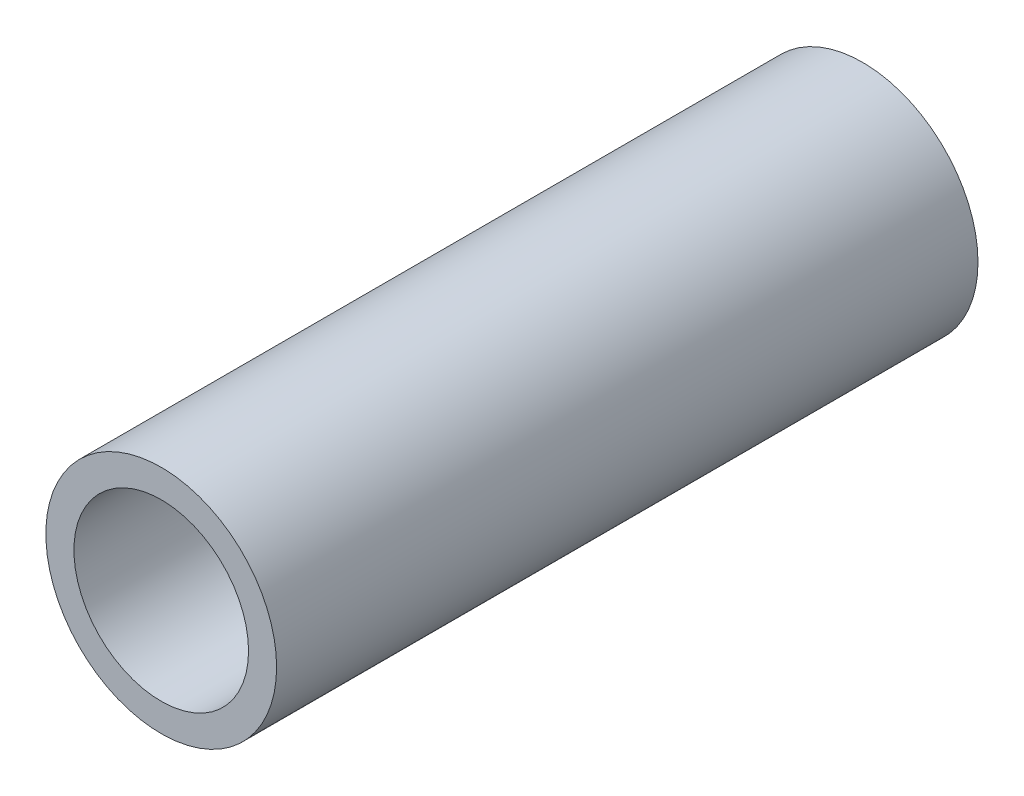
ISO-10303-21;
HEADER;
FILE_DESCRIPTION(('STEP AP214'),'2;1');
FILE_NAME('part.step','',(''),(''),'','','');
FILE_SCHEMA(('AUTOMOTIVE_DESIGN { 1 0 10303 214 1 1 1 1 }'));
ENDSEC;
DATA;
#1=APPLICATION_CONTEXT('core data for automotive mechanical design processes');
#2=APPLICATION_PROTOCOL_DEFINITION('international standard','automotive_design',2000,#1);
#3=PRODUCT_CONTEXT('',#1,'mechanical');
#4=PRODUCT('Part','Part','',(#3));
#5=PRODUCT_RELATED_PRODUCT_CATEGORY('part','',(#4));
#6=PRODUCT_DEFINITION_FORMATION('','',#4);
#7=PRODUCT_DEFINITION_CONTEXT('part definition',#1,'design');
#8=PRODUCT_DEFINITION('design','',#6,#7);
#9=PRODUCT_DEFINITION_SHAPE('','',#8);
#10=(LENGTH_UNIT() NAMED_UNIT(*) SI_UNIT(.MILLI.,.METRE.));
#11=(NAMED_UNIT(*) PLANE_ANGLE_UNIT() SI_UNIT($,.RADIAN.));
#12=(NAMED_UNIT(*) SI_UNIT($,.STERADIAN.) SOLID_ANGLE_UNIT());
#13=UNCERTAINTY_MEASURE_WITH_UNIT(LENGTH_MEASURE(1.E-05),#10,'distance_accuracy_value','');
#14=(GEOMETRIC_REPRESENTATION_CONTEXT(3) GLOBAL_UNCERTAINTY_ASSIGNED_CONTEXT((#13)) GLOBAL_UNIT_ASSIGNED_CONTEXT((#10,
#11,#12)) REPRESENTATION_CONTEXT('',''));
#15=CARTESIAN_POINT('',(0.,0.,0.));
#16=DIRECTION('',(0.,0.,1.));
#17=DIRECTION('',(1.,0.,0.));
#18=AXIS2_PLACEMENT_3D('',#15,#16,#17);
#19=CARTESIAN_POINT('',(0.,0.,50.));
#20=DIRECTION('',(0.,0.,1.));
#21=DIRECTION('',(1.,0.,0.));
#22=AXIS2_PLACEMENT_3D('',#19,#20,#21);
#23=PLANE('',#22);
#24=CARTESIAN_POINT('',(0.,0.,50.));
#25=DIRECTION('',(0.,0.,1.));
#26=DIRECTION('',(1.,0.,0.));
#27=AXIS2_PLACEMENT_3D('',#24,#25,#26);
#28=CIRCLE('',#27,16.45);
#29=CARTESIAN_POINT('',(16.45,0.,50.));
#30=VERTEX_POINT('',#29);
#31=EDGE_CURVE('E10',#30,#30,#28,.T.);
#32=ORIENTED_EDGE('',*,*,#31,.T.);
#33=EDGE_LOOP('',(#32));
#34=FACE_BOUND('',#33,.T.);
#35=CARTESIAN_POINT('',(0.,0.,50.));
#36=DIRECTION('',(0.,0.,1.));
#37=DIRECTION('',(1.,0.,0.));
#38=AXIS2_PLACEMENT_3D('',#35,#36,#37);
#39=CIRCLE('',#38,12.45);
#40=CARTESIAN_POINT('',(12.45,0.,50.));
#41=VERTEX_POINT('',#40);
#42=EDGE_CURVE('E48',#41,#41,#39,.T.);
#43=ORIENTED_EDGE('',*,*,#42,.F.);
#44=EDGE_LOOP('',(#43));
#45=FACE_BOUND('',#44,.T.);
#46=ADVANCED_FACE('F37',(#34,#45),#23,.T.);
#47=CARTESIAN_POINT('',(0.,0.,-50.));
#48=DIRECTION('',(0.,0.,1.));
#49=DIRECTION('',(1.,0.,0.));
#50=AXIS2_PLACEMENT_3D('',#47,#48,#49);
#51=PLANE('',#50);
#52=CARTESIAN_POINT('',(0.,0.,-50.));
#53=DIRECTION('',(0.,0.,1.));
#54=DIRECTION('',(1.,0.,0.));
#55=AXIS2_PLACEMENT_3D('',#52,#53,#54);
#56=CIRCLE('',#55,16.45);
#57=CARTESIAN_POINT('',(16.45,0.,-50.));
#58=VERTEX_POINT('',#57);
#59=EDGE_CURVE('E41',#58,#58,#56,.T.);
#60=ORIENTED_EDGE('',*,*,#59,.F.);
#61=EDGE_LOOP('',(#60));
#62=FACE_BOUND('',#61,.T.);
#63=CARTESIAN_POINT('',(0.,0.,-50.));
#64=DIRECTION('',(0.,0.,1.));
#65=DIRECTION('',(1.,0.,0.));
#66=AXIS2_PLACEMENT_3D('',#63,#64,#65);
#67=CIRCLE('',#66,12.45);
#68=CARTESIAN_POINT('',(12.45,0.,-50.));
#69=VERTEX_POINT('',#68);
#70=EDGE_CURVE('E50',#69,#69,#67,.T.);
#71=ORIENTED_EDGE('',*,*,#70,.T.);
#72=EDGE_LOOP('',(#71));
#73=FACE_BOUND('',#72,.T.);
#74=ADVANCED_FACE('F60',(#62,#73),#51,.F.);
#75=CARTESIAN_POINT('',(0.,0.,50.));
#76=DIRECTION('',(0.,0.,-1.));
#77=DIRECTION('',(-1.,0.,0.));
#78=AXIS2_PLACEMENT_3D('',#75,#76,#77);
#79=CYLINDRICAL_SURFACE('',#78,16.45);
#80=ORIENTED_EDGE('',*,*,#31,.F.);
#81=EDGE_LOOP('',(#80));
#82=FACE_BOUND('',#81,.T.);
#83=ORIENTED_EDGE('',*,*,#59,.T.);
#84=EDGE_LOOP('',(#83));
#85=FACE_BOUND('',#84,.T.);
#86=ADVANCED_FACE('F39',(#82,#85),#79,.T.);
#87=CARTESIAN_POINT('',(0.,0.,50.));
#88=DIRECTION('',(0.,0.,-1.));
#89=DIRECTION('',(-1.,0.,0.));
#90=AXIS2_PLACEMENT_3D('',#87,#88,#89);
#91=CYLINDRICAL_SURFACE('',#90,12.45);
#92=ORIENTED_EDGE('',*,*,#42,.T.);
#93=EDGE_LOOP('',(#92));
#94=FACE_BOUND('',#93,.T.);
#95=ORIENTED_EDGE('',*,*,#70,.F.);
#96=EDGE_LOOP('',(#95));
#97=FACE_BOUND('',#96,.T.);
#98=ADVANCED_FACE('F56',(#94,#97),#91,.F.);
#99=CLOSED_SHELL('',(#46,#74,#86,#98));
#100=MANIFOLD_SOLID_BREP('B2',#99);
#101=ADVANCED_BREP_SHAPE_REPRESENTATION('',(#18,#100),#14);
#102=SHAPE_DEFINITION_REPRESENTATION(#9,#101);
ENDSEC;
END-ISO-10303-21;
